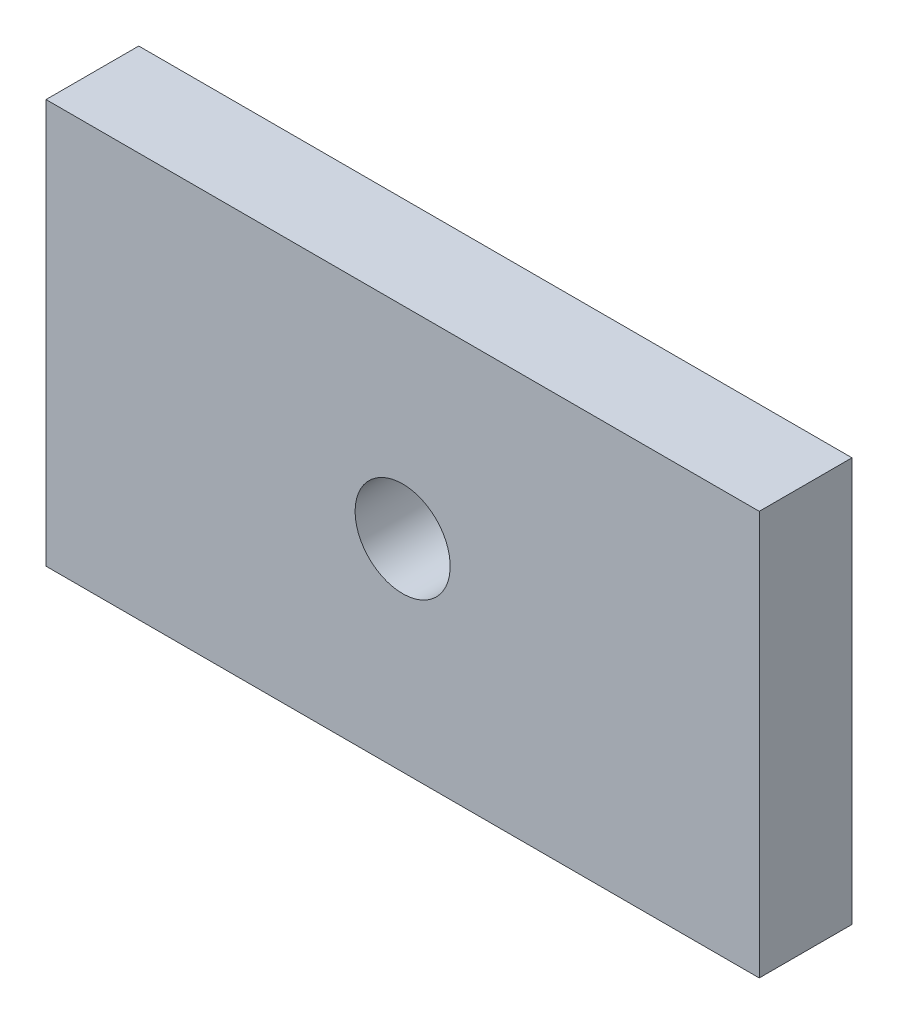
ISO-10303-21;
HEADER;
FILE_DESCRIPTION(('STEP AP214'),'2;1');
FILE_NAME('part.step','',(''),(''),'','','');
FILE_SCHEMA(('AUTOMOTIVE_DESIGN { 1 0 10303 214 1 1 1 1 }'));
ENDSEC;
DATA;
#1=APPLICATION_CONTEXT('core data for automotive mechanical design processes');
#2=APPLICATION_PROTOCOL_DEFINITION('international standard','automotive_design',2000,#1);
#3=PRODUCT_CONTEXT('',#1,'mechanical');
#4=PRODUCT('Part','Part','',(#3));
#5=PRODUCT_RELATED_PRODUCT_CATEGORY('part','',(#4));
#6=PRODUCT_DEFINITION_FORMATION('','',#4);
#7=PRODUCT_DEFINITION_CONTEXT('part definition',#1,'design');
#8=PRODUCT_DEFINITION('design','',#6,#7);
#9=PRODUCT_DEFINITION_SHAPE('','',#8);
#10=(LENGTH_UNIT() NAMED_UNIT(*) SI_UNIT(.MILLI.,.METRE.));
#11=(NAMED_UNIT(*) PLANE_ANGLE_UNIT() SI_UNIT($,.RADIAN.));
#12=(NAMED_UNIT(*) SI_UNIT($,.STERADIAN.) SOLID_ANGLE_UNIT());
#13=UNCERTAINTY_MEASURE_WITH_UNIT(LENGTH_MEASURE(1.E-05),#10,'distance_accuracy_value','');
#14=(GEOMETRIC_REPRESENTATION_CONTEXT(3) GLOBAL_UNCERTAINTY_ASSIGNED_CONTEXT((#13)) GLOBAL_UNIT_ASSIGNED_CONTEXT((#10,
#11,#12)) REPRESENTATION_CONTEXT('',''));
#15=CARTESIAN_POINT('',(0.,0.,0.));
#16=DIRECTION('',(0.,0.,1.));
#17=DIRECTION('',(1.,0.,0.));
#18=AXIS2_PLACEMENT_3D('',#15,#16,#17);
#19=CARTESIAN_POINT('',(-15.,0.,3.9));
#20=DIRECTION('',(1.,0.,0.));
#21=DIRECTION('',(0.,1.,0.));
#22=AXIS2_PLACEMENT_3D('',#19,#20,#21);
#23=PLANE('',#22);
#24=DIRECTION('',(0.,-1.,0.));
#25=VECTOR('',#24,1.);
#26=CARTESIAN_POINT('',(-15.,0.,0.));
#27=LINE('',#26,#25);
#28=CARTESIAN_POINT('',(-15.,17.,0.));
#29=VERTEX_POINT('',#28);
#30=CARTESIAN_POINT('',(-15.,0.,0.));
#31=VERTEX_POINT('',#30);
#32=EDGE_CURVE('E106',#29,#31,#27,.T.);
#33=ORIENTED_EDGE('',*,*,#32,.T.);
#34=DIRECTION('',(0.,0.,-1.));
#35=VECTOR('',#34,1.);
#36=CARTESIAN_POINT('',(-15.,0.,3.9));
#37=LINE('',#36,#35);
#38=CARTESIAN_POINT('',(-15.,0.,3.9));
#39=VERTEX_POINT('',#38);
#40=EDGE_CURVE('E11',#39,#31,#37,.T.);
#41=ORIENTED_EDGE('',*,*,#40,.F.);
#42=DIRECTION('',(0.,-1.,0.));
#43=VECTOR('',#42,1.);
#44=CARTESIAN_POINT('',(-15.,0.,3.9));
#45=LINE('',#44,#43);
#46=CARTESIAN_POINT('',(-15.,17.,3.9));
#47=VERTEX_POINT('',#46);
#48=EDGE_CURVE('E94',#47,#39,#45,.T.);
#49=ORIENTED_EDGE('',*,*,#48,.F.);
#50=DIRECTION('',(0.,0.,-1.));
#51=VECTOR('',#50,1.);
#52=CARTESIAN_POINT('',(-15.,17.,3.9));
#53=LINE('',#52,#51);
#54=EDGE_CURVE('E102',#47,#29,#53,.T.);
#55=ORIENTED_EDGE('',*,*,#54,.T.);
#56=EDGE_LOOP('',(#33,#41,#49,#55));
#57=FACE_BOUND('',#56,.T.);
#58=ADVANCED_FACE('F43',(#57),#23,.F.);
#59=CARTESIAN_POINT('',(-15.,0.,3.9));
#60=DIRECTION('',(0.,1.,0.));
#61=DIRECTION('',(-1.,0.,0.));
#62=AXIS2_PLACEMENT_3D('',#59,#60,#61);
#63=PLANE('',#62);
#64=DIRECTION('',(1.,0.,0.));
#65=VECTOR('',#64,1.);
#66=CARTESIAN_POINT('',(-15.,0.,0.));
#67=LINE('',#66,#65);
#68=CARTESIAN_POINT('',(15.,0.,0.));
#69=VERTEX_POINT('',#68);
#70=EDGE_CURVE('E98',#31,#69,#67,.T.);
#71=ORIENTED_EDGE('',*,*,#70,.T.);
#72=DIRECTION('',(0.,0.,-1.));
#73=VECTOR('',#72,1.);
#74=CARTESIAN_POINT('',(15.,0.,3.9));
#75=LINE('',#74,#73);
#76=CARTESIAN_POINT('',(15.,0.,3.9));
#77=VERTEX_POINT('',#76);
#78=EDGE_CURVE('E51',#77,#69,#75,.T.);
#79=ORIENTED_EDGE('',*,*,#78,.F.);
#80=DIRECTION('',(1.,0.,0.));
#81=VECTOR('',#80,1.);
#82=CARTESIAN_POINT('',(-15.,0.,3.9));
#83=LINE('',#82,#81);
#84=EDGE_CURVE('E89',#39,#77,#83,.T.);
#85=ORIENTED_EDGE('',*,*,#84,.F.);
#86=ORIENTED_EDGE('',*,*,#40,.T.);
#87=EDGE_LOOP('',(#71,#79,#85,#86));
#88=FACE_BOUND('',#87,.T.);
#89=ADVANCED_FACE('F97',(#88),#63,.F.);
#90=CARTESIAN_POINT('',(15.,0.,3.9));
#91=DIRECTION('',(-1.,0.,0.));
#92=DIRECTION('',(0.,0.,1.));
#93=AXIS2_PLACEMENT_3D('',#90,#91,#92);
#94=PLANE('',#93);
#95=DIRECTION('',(0.,1.,0.));
#96=VECTOR('',#95,1.);
#97=CARTESIAN_POINT('',(15.,0.,0.));
#98=LINE('',#97,#96);
#99=CARTESIAN_POINT('',(15.,17.,0.));
#100=VERTEX_POINT('',#99);
#101=EDGE_CURVE('E76',#69,#100,#98,.T.);
#102=ORIENTED_EDGE('',*,*,#101,.T.);
#103=DIRECTION('',(0.,0.,-1.));
#104=VECTOR('',#103,1.);
#105=CARTESIAN_POINT('',(15.,17.,3.9));
#106=LINE('',#105,#104);
#107=CARTESIAN_POINT('',(15.,17.,3.9));
#108=VERTEX_POINT('',#107);
#109=EDGE_CURVE('E99',#108,#100,#106,.T.);
#110=ORIENTED_EDGE('',*,*,#109,.F.);
#111=DIRECTION('',(0.,1.,0.));
#112=VECTOR('',#111,1.);
#113=CARTESIAN_POINT('',(15.,0.,3.9));
#114=LINE('',#113,#112);
#115=EDGE_CURVE('E92',#77,#108,#114,.T.);
#116=ORIENTED_EDGE('',*,*,#115,.F.);
#117=ORIENTED_EDGE('',*,*,#78,.T.);
#118=EDGE_LOOP('',(#102,#110,#116,#117));
#119=FACE_BOUND('',#118,.T.);
#120=ADVANCED_FACE('F100',(#119),#94,.F.);
#121=CARTESIAN_POINT('',(-15.,17.,3.9));
#122=DIRECTION('',(0.,-1.,0.));
#123=DIRECTION('',(1.,0.,0.));
#124=AXIS2_PLACEMENT_3D('',#121,#122,#123);
#125=PLANE('',#124);
#126=DIRECTION('',(-1.,0.,0.));
#127=VECTOR('',#126,1.);
#128=CARTESIAN_POINT('',(-15.,17.,0.));
#129=LINE('',#128,#127);
#130=EDGE_CURVE('E82',#100,#29,#129,.T.);
#131=ORIENTED_EDGE('',*,*,#130,.T.);
#132=ORIENTED_EDGE('',*,*,#54,.F.);
#133=DIRECTION('',(-1.,0.,0.));
#134=VECTOR('',#133,1.);
#135=CARTESIAN_POINT('',(-15.,17.,3.9));
#136=LINE('',#135,#134);
#137=EDGE_CURVE('E59',#108,#47,#136,.T.);
#138=ORIENTED_EDGE('',*,*,#137,.F.);
#139=ORIENTED_EDGE('',*,*,#109,.T.);
#140=EDGE_LOOP('',(#131,#132,#138,#139));
#141=FACE_BOUND('',#140,.T.);
#142=ADVANCED_FACE('F114',(#141),#125,.F.);
#143=CARTESIAN_POINT('',(0.,0.,3.9));
#144=DIRECTION('',(0.,0.,-1.));
#145=DIRECTION('',(-1.,0.,0.));
#146=AXIS2_PLACEMENT_3D('',#143,#144,#145);
#147=PLANE('',#146);
#148=CARTESIAN_POINT('',(0.,8.5,3.9));
#149=DIRECTION('',(0.,0.,-1.));
#150=DIRECTION('',(-1.,0.,0.));
#151=AXIS2_PLACEMENT_3D('',#148,#149,#150);
#152=CIRCLE('',#151,1.99999999999999);
#153=CARTESIAN_POINT('',(-1.99999999999999,8.5,3.9));
#154=VERTEX_POINT('',#153);
#155=EDGE_CURVE('E109',#154,#154,#152,.T.);
#156=ORIENTED_EDGE('',*,*,#155,.T.);
#157=EDGE_LOOP('',(#156));
#158=FACE_BOUND('',#157,.T.);
#159=ORIENTED_EDGE('',*,*,#48,.T.);
#160=ORIENTED_EDGE('',*,*,#84,.T.);
#161=ORIENTED_EDGE('',*,*,#115,.T.);
#162=ORIENTED_EDGE('',*,*,#137,.T.);
#163=EDGE_LOOP('',(#159,#160,#161,#162));
#164=FACE_BOUND('',#163,.T.);
#165=ADVANCED_FACE('F90',(#158,#164),#147,.F.);
#166=CARTESIAN_POINT('',(0.,0.,0.));
#167=DIRECTION('',(0.,0.,-1.));
#168=DIRECTION('',(-1.,0.,0.));
#169=AXIS2_PLACEMENT_3D('',#166,#167,#168);
#170=PLANE('',#169);
#171=CARTESIAN_POINT('',(0.,8.5,0.));
#172=DIRECTION('',(0.,0.,-1.));
#173=DIRECTION('',(-1.,0.,0.));
#174=AXIS2_PLACEMENT_3D('',#171,#172,#173);
#175=CIRCLE('',#174,1.99999999999999);
#176=CARTESIAN_POINT('',(-1.99999999999999,8.5,0.));
#177=VERTEX_POINT('',#176);
#178=EDGE_CURVE('E122',#177,#177,#175,.T.);
#179=ORIENTED_EDGE('',*,*,#178,.F.);
#180=EDGE_LOOP('',(#179));
#181=FACE_BOUND('',#180,.T.);
#182=ORIENTED_EDGE('',*,*,#32,.F.);
#183=ORIENTED_EDGE('',*,*,#130,.F.);
#184=ORIENTED_EDGE('',*,*,#101,.F.);
#185=ORIENTED_EDGE('',*,*,#70,.F.);
#186=EDGE_LOOP('',(#182,#183,#184,#185));
#187=FACE_BOUND('',#186,.T.);
#188=ADVANCED_FACE('F117',(#181,#187),#170,.T.);
#189=CARTESIAN_POINT('',(0.,8.5,0.));
#190=DIRECTION('',(0.,0.,-1.));
#191=DIRECTION('',(-1.,0.,0.));
#192=AXIS2_PLACEMENT_3D('',#189,#190,#191);
#193=CYLINDRICAL_SURFACE('',#192,1.99999999999999);
#194=ORIENTED_EDGE('',*,*,#155,.F.);
#195=EDGE_LOOP('',(#194));
#196=FACE_BOUND('',#195,.T.);
#197=ORIENTED_EDGE('',*,*,#178,.T.);
#198=EDGE_LOOP('',(#197));
#199=FACE_BOUND('',#198,.T.);
#200=ADVANCED_FACE('F126',(#196,#199),#193,.F.);
#201=CLOSED_SHELL('',(#58,#89,#120,#142,#165,#188,#200));
#202=MANIFOLD_SOLID_BREP('B2',#201);
#203=ADVANCED_BREP_SHAPE_REPRESENTATION('',(#18,#202),#14);
#204=SHAPE_DEFINITION_REPRESENTATION(#9,#203);
ENDSEC;
END-ISO-10303-21;
